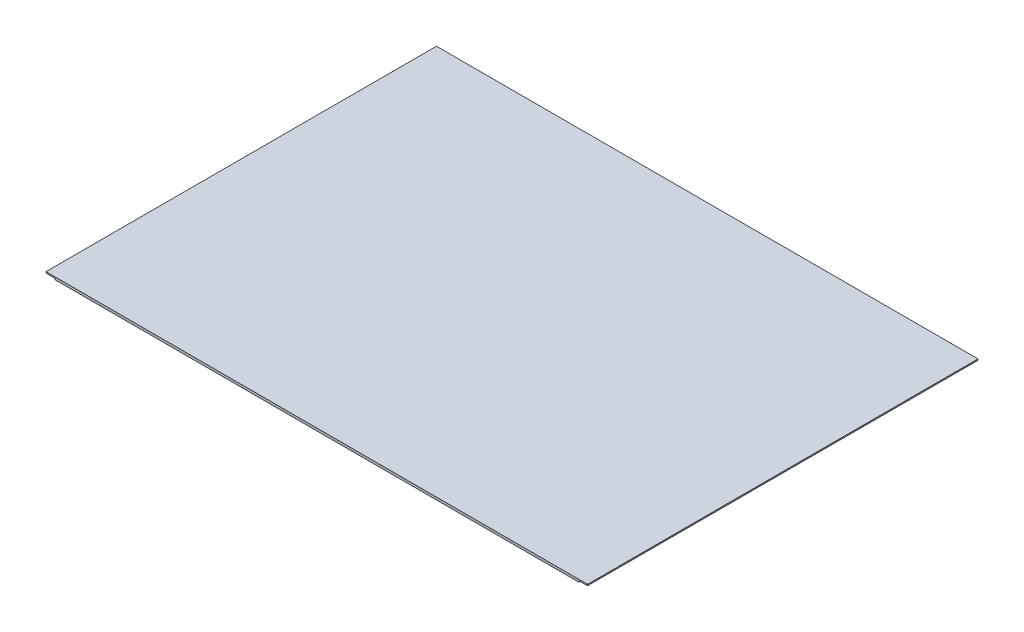
ISO-10303-21;
HEADER;
FILE_DESCRIPTION(('STEP AP214'),'2;1');
FILE_NAME('part.step','',(''),(''),'','','');
FILE_SCHEMA(('AUTOMOTIVE_DESIGN { 1 0 10303 214 1 1 1 1 }'));
ENDSEC;
DATA;
#1=APPLICATION_CONTEXT('core data for automotive mechanical design processes');
#2=APPLICATION_PROTOCOL_DEFINITION('international standard','automotive_design',2000,#1);
#3=PRODUCT_CONTEXT('',#1,'mechanical');
#4=PRODUCT('Part','Part','',(#3));
#5=PRODUCT_RELATED_PRODUCT_CATEGORY('part','',(#4));
#6=PRODUCT_DEFINITION_FORMATION('','',#4);
#7=PRODUCT_DEFINITION_CONTEXT('part definition',#1,'design');
#8=PRODUCT_DEFINITION('design','',#6,#7);
#9=PRODUCT_DEFINITION_SHAPE('','',#8);
#10=(LENGTH_UNIT() NAMED_UNIT(*) SI_UNIT(.MILLI.,.METRE.));
#11=(NAMED_UNIT(*) PLANE_ANGLE_UNIT() SI_UNIT($,.RADIAN.));
#12=(NAMED_UNIT(*) SI_UNIT($,.STERADIAN.) SOLID_ANGLE_UNIT());
#13=UNCERTAINTY_MEASURE_WITH_UNIT(LENGTH_MEASURE(1.E-05),#10,'distance_accuracy_value','');
#14=(GEOMETRIC_REPRESENTATION_CONTEXT(3) GLOBAL_UNCERTAINTY_ASSIGNED_CONTEXT((#13)) GLOBAL_UNIT_ASSIGNED_CONTEXT((#10,
#11,#12)) REPRESENTATION_CONTEXT('',''));
#15=CARTESIAN_POINT('',(0.,0.,0.));
#16=DIRECTION('',(0.,0.,1.));
#17=DIRECTION('',(1.,0.,0.));
#18=AXIS2_PLACEMENT_3D('',#15,#16,#17);
#19=CARTESIAN_POINT('',(215.,2.,-155.));
#20=DIRECTION('',(-1.,0.,0.));
#21=DIRECTION('',(0.,0.,1.));
#22=AXIS2_PLACEMENT_3D('',#19,#20,#21);
#23=PLANE('',#22);
#24=DIRECTION('',(0.,-1.,0.));
#25=VECTOR('',#24,1.);
#26=CARTESIAN_POINT('',(215.,2.,155.));
#27=LINE('',#26,#25);
#28=CARTESIAN_POINT('',(215.,2.,155.));
#29=VERTEX_POINT('',#28);
#30=CARTESIAN_POINT('',(215.,1.,155.));
#31=VERTEX_POINT('',#30);
#32=EDGE_CURVE('E117',#29,#31,#27,.T.);
#33=ORIENTED_EDGE('',*,*,#32,.T.);
#34=DIRECTION('',(0.,0.,1.));
#35=VECTOR('',#34,1.);
#36=CARTESIAN_POINT('',(215.,1.,-155.));
#37=LINE('',#36,#35);
#38=CARTESIAN_POINT('',(215.,1.,-155.));
#39=VERTEX_POINT('',#38);
#40=EDGE_CURVE('E106',#39,#31,#37,.T.);
#41=ORIENTED_EDGE('',*,*,#40,.F.);
#42=DIRECTION('',(0.,-1.,0.));
#43=VECTOR('',#42,1.);
#44=CARTESIAN_POINT('',(215.,2.,-155.));
#45=LINE('',#44,#43);
#46=CARTESIAN_POINT('',(215.,2.,-155.));
#47=VERTEX_POINT('',#46);
#48=EDGE_CURVE('E11',#47,#39,#45,.T.);
#49=ORIENTED_EDGE('',*,*,#48,.F.);
#50=DIRECTION('',(0.,0.,-1.));
#51=VECTOR('',#50,1.);
#52=CARTESIAN_POINT('',(215.,2.,-155.));
#53=LINE('',#52,#51);
#54=EDGE_CURVE('E128',#29,#47,#53,.T.);
#55=ORIENTED_EDGE('',*,*,#54,.F.);
#56=EDGE_LOOP('',(#33,#41,#49,#55));
#57=FACE_BOUND('',#56,.T.);
#58=ADVANCED_FACE('F37',(#57),#23,.F.);
#59=CARTESIAN_POINT('',(-215.,2.,-155.));
#60=DIRECTION('',(0.,0.,1.));
#61=DIRECTION('',(1.,0.,0.));
#62=AXIS2_PLACEMENT_3D('',#59,#60,#61);
#63=PLANE('',#62);
#64=DIRECTION('',(-1.,0.,0.));
#65=VECTOR('',#64,1.);
#66=CARTESIAN_POINT('',(215.,1.,-155.));
#67=LINE('',#66,#65);
#68=CARTESIAN_POINT('',(208.,1.,-155.));
#69=VERTEX_POINT('',#68);
#70=EDGE_CURVE('E102',#39,#69,#67,.T.);
#71=ORIENTED_EDGE('',*,*,#70,.T.);
#72=DIRECTION('',(0.,-1.,0.));
#73=VECTOR('',#72,1.);
#74=CARTESIAN_POINT('',(208.,1.,-155.));
#75=LINE('',#74,#73);
#76=CARTESIAN_POINT('',(208.,0.,-155.));
#77=VERTEX_POINT('',#76);
#78=EDGE_CURVE('E110',#69,#77,#75,.T.);
#79=ORIENTED_EDGE('',*,*,#78,.T.);
#80=DIRECTION('',(-1.,0.,0.));
#81=VECTOR('',#80,1.);
#82=CARTESIAN_POINT('',(-215.,0.,-155.));
#83=LINE('',#82,#81);
#84=CARTESIAN_POINT('',(-208.,0.,-155.));
#85=VERTEX_POINT('',#84);
#86=EDGE_CURVE('E59',#77,#85,#83,.T.);
#87=ORIENTED_EDGE('',*,*,#86,.T.);
#88=DIRECTION('',(0.,1.,0.));
#89=VECTOR('',#88,1.);
#90=CARTESIAN_POINT('',(-208.,1.,-155.));
#91=LINE('',#90,#89);
#92=CARTESIAN_POINT('',(-208.,1.,-155.));
#93=VERTEX_POINT('',#92);
#94=EDGE_CURVE('E164',#85,#93,#91,.T.);
#95=ORIENTED_EDGE('',*,*,#94,.T.);
#96=DIRECTION('',(-1.,0.,0.));
#97=VECTOR('',#96,1.);
#98=CARTESIAN_POINT('',(-215.,1.,-155.));
#99=LINE('',#98,#97);
#100=CARTESIAN_POINT('',(-215.,1.,-155.));
#101=VERTEX_POINT('',#100);
#102=EDGE_CURVE('E166',#93,#101,#99,.T.);
#103=ORIENTED_EDGE('',*,*,#102,.T.);
#104=DIRECTION('',(0.,-1.,0.));
#105=VECTOR('',#104,1.);
#106=CARTESIAN_POINT('',(-215.,2.,-155.));
#107=LINE('',#106,#105);
#108=CARTESIAN_POINT('',(-215.,2.,-155.));
#109=VERTEX_POINT('',#108);
#110=EDGE_CURVE('E44',#109,#101,#107,.T.);
#111=ORIENTED_EDGE('',*,*,#110,.F.);
#112=DIRECTION('',(-1.,0.,0.));
#113=VECTOR('',#112,1.);
#114=CARTESIAN_POINT('',(-215.,2.,-155.));
#115=LINE('',#114,#113);
#116=EDGE_CURVE('E121',#47,#109,#115,.T.);
#117=ORIENTED_EDGE('',*,*,#116,.F.);
#118=ORIENTED_EDGE('',*,*,#48,.T.);
#119=EDGE_LOOP('',(#71,#79,#87,#95,#103,#111,#117,#118));
#120=FACE_BOUND('',#119,.T.);
#121=ADVANCED_FACE('F119',(#120),#63,.F.);
#122=CARTESIAN_POINT('',(-215.,2.,-155.));
#123=DIRECTION('',(1.,0.,0.));
#124=DIRECTION('',(0.,0.,-1.));
#125=AXIS2_PLACEMENT_3D('',#122,#123,#124);
#126=PLANE('',#125);
#127=ORIENTED_EDGE('',*,*,#110,.T.);
#128=DIRECTION('',(0.,0.,1.));
#129=VECTOR('',#128,1.);
#130=CARTESIAN_POINT('',(-215.,1.,-155.));
#131=LINE('',#130,#129);
#132=CARTESIAN_POINT('',(-215.,1.,155.));
#133=VERTEX_POINT('',#132);
#134=EDGE_CURVE('E143',#101,#133,#131,.T.);
#135=ORIENTED_EDGE('',*,*,#134,.T.);
#136=DIRECTION('',(0.,-1.,0.));
#137=VECTOR('',#136,1.);
#138=CARTESIAN_POINT('',(-215.,2.,155.));
#139=LINE('',#138,#137);
#140=CARTESIAN_POINT('',(-215.,2.,155.));
#141=VERTEX_POINT('',#140);
#142=EDGE_CURVE('E146',#141,#133,#139,.T.);
#143=ORIENTED_EDGE('',*,*,#142,.F.);
#144=DIRECTION('',(0.,0.,1.));
#145=VECTOR('',#144,1.);
#146=CARTESIAN_POINT('',(-215.,2.,-155.));
#147=LINE('',#146,#145);
#148=EDGE_CURVE('E127',#109,#141,#147,.T.);
#149=ORIENTED_EDGE('',*,*,#148,.F.);
#150=EDGE_LOOP('',(#127,#135,#143,#149));
#151=FACE_BOUND('',#150,.T.);
#152=ADVANCED_FACE('F150',(#151),#126,.F.);
#153=CARTESIAN_POINT('',(-215.,2.,155.));
#154=DIRECTION('',(0.,0.,-1.));
#155=DIRECTION('',(-1.,0.,0.));
#156=AXIS2_PLACEMENT_3D('',#153,#154,#155);
#157=PLANE('',#156);
#158=DIRECTION('',(1.,0.,0.));
#159=VECTOR('',#158,1.);
#160=CARTESIAN_POINT('',(-215.,0.,155.));
#161=LINE('',#160,#159);
#162=CARTESIAN_POINT('',(-208.,0.,155.));
#163=VERTEX_POINT('',#162);
#164=CARTESIAN_POINT('',(208.,0.,155.));
#165=VERTEX_POINT('',#164);
#166=EDGE_CURVE('E133',#163,#165,#161,.T.);
#167=ORIENTED_EDGE('',*,*,#166,.T.);
#168=DIRECTION('',(0.,-1.,0.));
#169=VECTOR('',#168,1.);
#170=CARTESIAN_POINT('',(208.,1.,155.));
#171=LINE('',#170,#169);
#172=CARTESIAN_POINT('',(208.,1.,155.));
#173=VERTEX_POINT('',#172);
#174=EDGE_CURVE('E51',#173,#165,#171,.T.);
#175=ORIENTED_EDGE('',*,*,#174,.F.);
#176=DIRECTION('',(-1.,0.,0.));
#177=VECTOR('',#176,1.);
#178=CARTESIAN_POINT('',(215.,1.,155.));
#179=LINE('',#178,#177);
#180=EDGE_CURVE('E155',#31,#173,#179,.T.);
#181=ORIENTED_EDGE('',*,*,#180,.F.);
#182=ORIENTED_EDGE('',*,*,#32,.F.);
#183=DIRECTION('',(1.,0.,0.));
#184=VECTOR('',#183,1.);
#185=CARTESIAN_POINT('',(-215.,2.,155.));
#186=LINE('',#185,#184);
#187=EDGE_CURVE('E132',#141,#29,#186,.T.);
#188=ORIENTED_EDGE('',*,*,#187,.F.);
#189=ORIENTED_EDGE('',*,*,#142,.T.);
#190=DIRECTION('',(-1.,0.,0.));
#191=VECTOR('',#190,1.);
#192=CARTESIAN_POINT('',(-215.,1.,155.));
#193=LINE('',#192,#191);
#194=CARTESIAN_POINT('',(-208.,1.,155.));
#195=VERTEX_POINT('',#194);
#196=EDGE_CURVE('E167',#195,#133,#193,.T.);
#197=ORIENTED_EDGE('',*,*,#196,.F.);
#198=DIRECTION('',(0.,1.,0.));
#199=VECTOR('',#198,1.);
#200=CARTESIAN_POINT('',(-208.,1.,155.));
#201=LINE('',#200,#199);
#202=EDGE_CURVE('E162',#163,#195,#201,.T.);
#203=ORIENTED_EDGE('',*,*,#202,.F.);
#204=EDGE_LOOP('',(#167,#175,#181,#182,#188,#189,#197,#203));
#205=FACE_BOUND('',#204,.T.);
#206=ADVANCED_FACE('F154',(#205),#157,.F.);
#207=CARTESIAN_POINT('',(0.,2.,0.));
#208=DIRECTION('',(0.,1.,0.));
#209=DIRECTION('',(0.,0.,1.));
#210=AXIS2_PLACEMENT_3D('',#207,#208,#209);
#211=PLANE('',#210);
#212=ORIENTED_EDGE('',*,*,#54,.T.);
#213=ORIENTED_EDGE('',*,*,#116,.T.);
#214=ORIENTED_EDGE('',*,*,#148,.T.);
#215=ORIENTED_EDGE('',*,*,#187,.T.);
#216=EDGE_LOOP('',(#212,#213,#214,#215));
#217=FACE_BOUND('',#216,.T.);
#218=ADVANCED_FACE('F130',(#217),#211,.T.);
#219=CARTESIAN_POINT('',(0.,0.,0.));
#220=DIRECTION('',(0.,1.,0.));
#221=DIRECTION('',(0.,0.,1.));
#222=AXIS2_PLACEMENT_3D('',#219,#220,#221);
#223=PLANE('',#222);
#224=ORIENTED_EDGE('',*,*,#86,.F.);
#225=DIRECTION('',(0.,0.,1.));
#226=VECTOR('',#225,1.);
#227=CARTESIAN_POINT('',(208.,0.,-155.));
#228=LINE('',#227,#226);
#229=EDGE_CURVE('E160',#77,#165,#228,.T.);
#230=ORIENTED_EDGE('',*,*,#229,.T.);
#231=ORIENTED_EDGE('',*,*,#166,.F.);
#232=DIRECTION('',(0.,0.,1.));
#233=VECTOR('',#232,1.);
#234=CARTESIAN_POINT('',(-208.,0.,-155.));
#235=LINE('',#234,#233);
#236=EDGE_CURVE('E138',#85,#163,#235,.T.);
#237=ORIENTED_EDGE('',*,*,#236,.F.);
#238=EDGE_LOOP('',(#224,#230,#231,#237));
#239=FACE_BOUND('',#238,.T.);
#240=ADVANCED_FACE('F181',(#239),#223,.F.);
#241=CARTESIAN_POINT('',(-215.,1.,-155.));
#242=DIRECTION('',(0.,1.,0.));
#243=DIRECTION('',(0.,0.,1.));
#244=AXIS2_PLACEMENT_3D('',#241,#242,#243);
#245=PLANE('',#244);
#246=ORIENTED_EDGE('',*,*,#196,.T.);
#247=ORIENTED_EDGE('',*,*,#134,.F.);
#248=ORIENTED_EDGE('',*,*,#102,.F.);
#249=DIRECTION('',(0.,0.,1.));
#250=VECTOR('',#249,1.);
#251=CARTESIAN_POINT('',(-208.,1.,-155.));
#252=LINE('',#251,#250);
#253=EDGE_CURVE('E172',#93,#195,#252,.T.);
#254=ORIENTED_EDGE('',*,*,#253,.T.);
#255=EDGE_LOOP('',(#246,#247,#248,#254));
#256=FACE_BOUND('',#255,.T.);
#257=ADVANCED_FACE('F190',(#256),#245,.F.);
#258=CARTESIAN_POINT('',(-208.,1.,-155.));
#259=DIRECTION('',(1.,0.,0.));
#260=DIRECTION('',(0.,0.,-1.));
#261=AXIS2_PLACEMENT_3D('',#258,#259,#260);
#262=PLANE('',#261);
#263=ORIENTED_EDGE('',*,*,#202,.T.);
#264=ORIENTED_EDGE('',*,*,#253,.F.);
#265=ORIENTED_EDGE('',*,*,#94,.F.);
#266=ORIENTED_EDGE('',*,*,#236,.T.);
#267=EDGE_LOOP('',(#263,#264,#265,#266));
#268=FACE_BOUND('',#267,.T.);
#269=ADVANCED_FACE('F178',(#268),#262,.F.);
#270=CARTESIAN_POINT('',(208.,1.,-155.));
#271=DIRECTION('',(-1.,0.,0.));
#272=DIRECTION('',(0.,0.,1.));
#273=AXIS2_PLACEMENT_3D('',#270,#271,#272);
#274=PLANE('',#273);
#275=ORIENTED_EDGE('',*,*,#174,.T.);
#276=ORIENTED_EDGE('',*,*,#229,.F.);
#277=ORIENTED_EDGE('',*,*,#78,.F.);
#278=DIRECTION('',(0.,0.,1.));
#279=VECTOR('',#278,1.);
#280=CARTESIAN_POINT('',(208.,1.,-155.));
#281=LINE('',#280,#279);
#282=EDGE_CURVE('E108',#69,#173,#281,.T.);
#283=ORIENTED_EDGE('',*,*,#282,.T.);
#284=EDGE_LOOP('',(#275,#276,#277,#283));
#285=FACE_BOUND('',#284,.T.);
#286=ADVANCED_FACE('F182',(#285),#274,.F.);
#287=CARTESIAN_POINT('',(215.,1.,-155.));
#288=DIRECTION('',(0.,1.,0.));
#289=DIRECTION('',(0.,0.,1.));
#290=AXIS2_PLACEMENT_3D('',#287,#288,#289);
#291=PLANE('',#290);
#292=ORIENTED_EDGE('',*,*,#180,.T.);
#293=ORIENTED_EDGE('',*,*,#282,.F.);
#294=ORIENTED_EDGE('',*,*,#70,.F.);
#295=ORIENTED_EDGE('',*,*,#40,.T.);
#296=EDGE_LOOP('',(#292,#293,#294,#295));
#297=FACE_BOUND('',#296,.T.);
#298=ADVANCED_FACE('F105',(#297),#291,.F.);
#299=CLOSED_SHELL('',(#58,#121,#152,#206,#218,#240,#257,#269,#286,#298));
#300=MANIFOLD_SOLID_BREP('B2',#299);
#301=ADVANCED_BREP_SHAPE_REPRESENTATION('',(#18,#300),#14);
#302=SHAPE_DEFINITION_REPRESENTATION(#9,#301);
ENDSEC;
END-ISO-10303-21;
